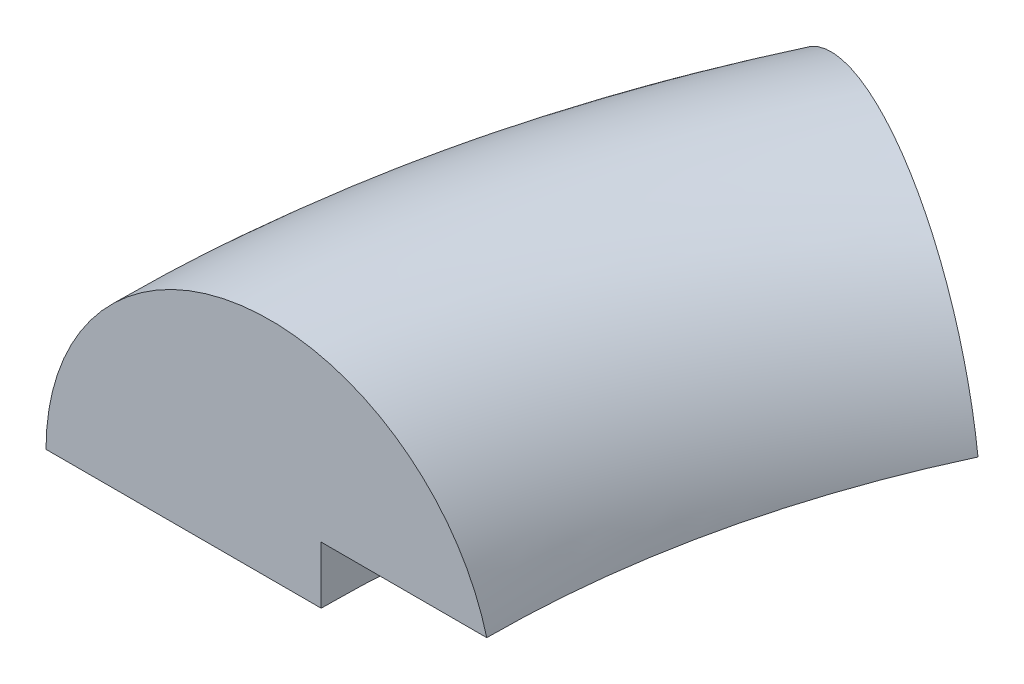
ISO-10303-21;
HEADER;
FILE_DESCRIPTION(('STEP AP214'),'2;1');
FILE_NAME('part.step','',(''),(''),'','','');
FILE_SCHEMA(('AUTOMOTIVE_DESIGN { 1 0 10303 214 1 1 1 1 }'));
ENDSEC;
DATA;
#1=APPLICATION_CONTEXT('core data for automotive mechanical design processes');
#2=APPLICATION_PROTOCOL_DEFINITION('international standard','automotive_design',2000,#1);
#3=PRODUCT_CONTEXT('',#1,'mechanical');
#4=PRODUCT('Part','Part','',(#3));
#5=PRODUCT_RELATED_PRODUCT_CATEGORY('part','',(#4));
#6=PRODUCT_DEFINITION_FORMATION('','',#4);
#7=PRODUCT_DEFINITION_CONTEXT('part definition',#1,'design');
#8=PRODUCT_DEFINITION('design','',#6,#7);
#9=PRODUCT_DEFINITION_SHAPE('','',#8);
#10=(LENGTH_UNIT() NAMED_UNIT(*) SI_UNIT(.MILLI.,.METRE.));
#11=(NAMED_UNIT(*) PLANE_ANGLE_UNIT() SI_UNIT($,.RADIAN.));
#12=(NAMED_UNIT(*) SI_UNIT($,.STERADIAN.) SOLID_ANGLE_UNIT());
#13=UNCERTAINTY_MEASURE_WITH_UNIT(LENGTH_MEASURE(1.E-05),#10,'distance_accuracy_value','');
#14=(GEOMETRIC_REPRESENTATION_CONTEXT(3) GLOBAL_UNCERTAINTY_ASSIGNED_CONTEXT((#13)) GLOBAL_UNIT_ASSIGNED_CONTEXT((#10,
#11,#12)) REPRESENTATION_CONTEXT('',''));
#15=CARTESIAN_POINT('',(0.,0.,0.));
#16=DIRECTION('',(0.,0.,1.));
#17=DIRECTION('',(1.,0.,0.));
#18=AXIS2_PLACEMENT_3D('',#15,#16,#17);
#19=CARTESIAN_POINT('',(0.,0.,0.));
#20=DIRECTION('',(0.,1.,0.));
#21=DIRECTION('',(0.,0.,1.));
#22=AXIS2_PLACEMENT_3D('',#19,#20,#21);
#23=TOROIDAL_SURFACE('',#22,21.2275921635679,4.07240783643207);
#24=CARTESIAN_POINT('',(0.,1.04084600278169,0.));
#25=DIRECTION('',(0.,1.,0.));
#26=DIRECTION('',(0.,0.,1.));
#27=AXIS2_PLACEMENT_3D('',#24,#25,#26);
#28=CIRCLE('',#27,17.2904427906426);
#29=CARTESIAN_POINT('',(-15.670462942471,1.04084600278169,-7.30725687690838));
#30=VERTEX_POINT('',#29);
#31=CARTESIAN_POINT('',(-17.2904427906426,1.04084600278169,0.));
#32=VERTEX_POINT('',#31);
#33=EDGE_CURVE('E11',#30,#32,#28,.T.);
#34=ORIENTED_EDGE('',*,*,#33,.F.);
#35=CARTESIAN_POINT('',(-19.2387320778798,0.,-8.97116810110759));
#36=DIRECTION('',(-0.4226182617407,0.,0.90630778703665));
#37=DIRECTION('',(-0.90630778703665,0.,-0.4226182617407));
#38=AXIS2_PLACEMENT_3D('',#35,#36,#37);
#39=CIRCLE('',#38,4.07240783643207);
#40=CARTESIAN_POINT('',(-22.9295870120272,0.,-10.6922420220397));
#41=VERTEX_POINT('',#40);
#42=EDGE_CURVE('E77',#30,#41,#39,.T.);
#43=ORIENTED_EDGE('',*,*,#42,.T.);
#44=CARTESIAN_POINT('',(0.,0.,0.));
#45=DIRECTION('',(0.,1.,0.));
#46=DIRECTION('',(0.,0.,1.));
#47=AXIS2_PLACEMENT_3D('',#44,#45,#46);
#48=CIRCLE('',#47,25.3);
#49=CARTESIAN_POINT('',(-25.3,0.,0.));
#50=VERTEX_POINT('',#49);
#51=EDGE_CURVE('E72',#41,#50,#48,.T.);
#52=ORIENTED_EDGE('',*,*,#51,.T.);
#53=CARTESIAN_POINT('',(-21.2275921635679,0.,0.));
#54=DIRECTION('',(0.,0.,1.));
#55=DIRECTION('',(-1.,0.,0.));
#56=AXIS2_PLACEMENT_3D('',#53,#54,#55);
#57=CIRCLE('',#56,4.07240783643207);
#58=EDGE_CURVE('E75',#32,#50,#57,.T.);
#59=ORIENTED_EDGE('',*,*,#58,.F.);
#60=EDGE_LOOP('',(#34,#43,#52,#59));
#61=FACE_BOUND('',#60,.T.);
#62=ADVANCED_FACE('F36',(#61),#23,.T.);
#63=CARTESIAN_POINT('',(-18.398048076844,1.04084600278169,-8.57915071333622));
#64=DIRECTION('',(0.,-1.,0.));
#65=DIRECTION('',(0.,0.,-1.));
#66=AXIS2_PLACEMENT_3D('',#63,#64,#65);
#67=PLANE('',#66);
#68=CARTESIAN_POINT('',(0.,1.04084600278169,0.));
#69=DIRECTION('',(0.,1.,0.));
#70=DIRECTION('',(0.,0.,1.));
#71=AXIS2_PLACEMENT_3D('',#68,#69,#70);
#72=CIRCLE('',#71,20.3);
#73=CARTESIAN_POINT('',(-18.398048076844,1.04084600278169,-8.57915071333622));
#74=VERTEX_POINT('',#73);
#75=CARTESIAN_POINT('',(-20.3,1.04084600278169,0.));
#76=VERTEX_POINT('',#75);
#77=EDGE_CURVE('E44',#74,#76,#72,.T.);
#78=ORIENTED_EDGE('',*,*,#77,.F.);
#79=DIRECTION('',(0.906307787036649,0.,0.4226182617407));
#80=VECTOR('',#79,1.);
#81=CARTESIAN_POINT('',(-18.398048076844,1.04084600278169,-8.57915071333622));
#82=LINE('',#81,#80);
#83=EDGE_CURVE('E82',#74,#30,#82,.T.);
#84=ORIENTED_EDGE('',*,*,#83,.T.);
#85=ORIENTED_EDGE('',*,*,#33,.T.);
#86=DIRECTION('',(1.,0.,0.));
#87=VECTOR('',#86,1.);
#88=CARTESIAN_POINT('',(-20.3,1.04084600278169,0.));
#89=LINE('',#88,#87);
#90=EDGE_CURVE('E94',#76,#32,#89,.T.);
#91=ORIENTED_EDGE('',*,*,#90,.F.);
#92=EDGE_LOOP('',(#78,#84,#85,#91));
#93=FACE_BOUND('',#92,.T.);
#94=ADVANCED_FACE('F38',(#93),#67,.T.);
#95=CARTESIAN_POINT('',(0.,5.05895341240825,0.));
#96=DIRECTION('',(0.,1.,0.));
#97=DIRECTION('',(0.,0.,1.));
#98=AXIS2_PLACEMENT_3D('',#95,#96,#97);
#99=CYLINDRICAL_SURFACE('',#98,20.3);
#100=CARTESIAN_POINT('',(0.,0.,0.));
#101=DIRECTION('',(0.,1.,0.));
#102=DIRECTION('',(0.,0.,1.));
#103=AXIS2_PLACEMENT_3D('',#100,#101,#102);
#104=CIRCLE('',#103,20.3);
#105=CARTESIAN_POINT('',(-18.398048076844,0.,-8.57915071333622));
#106=VERTEX_POINT('',#105);
#107=CARTESIAN_POINT('',(-20.3,0.,0.));
#108=VERTEX_POINT('',#107);
#109=EDGE_CURVE('E81',#106,#108,#104,.T.);
#110=ORIENTED_EDGE('',*,*,#109,.F.);
#111=DIRECTION('',(0.,1.,0.));
#112=VECTOR('',#111,1.);
#113=CARTESIAN_POINT('',(-18.398048076844,0.,-8.57915071333622));
#114=LINE('',#113,#112);
#115=EDGE_CURVE('E102',#106,#74,#114,.T.);
#116=ORIENTED_EDGE('',*,*,#115,.T.);
#117=ORIENTED_EDGE('',*,*,#77,.T.);
#118=DIRECTION('',(0.,1.,0.));
#119=VECTOR('',#118,1.);
#120=CARTESIAN_POINT('',(-20.3,0.,0.));
#121=LINE('',#120,#119);
#122=EDGE_CURVE('E90',#108,#76,#121,.T.);
#123=ORIENTED_EDGE('',*,*,#122,.F.);
#124=EDGE_LOOP('',(#110,#116,#117,#123));
#125=FACE_BOUND('',#124,.T.);
#126=ADVANCED_FACE('F106',(#125),#99,.F.);
#127=CARTESIAN_POINT('',(-22.9295870120272,0.,-10.6922420220397));
#128=DIRECTION('',(0.,-1.,0.));
#129=DIRECTION('',(0.,0.,-1.));
#130=AXIS2_PLACEMENT_3D('',#127,#128,#129);
#131=PLANE('',#130);
#132=DIRECTION('',(0.906307787036649,0.,0.4226182617407));
#133=VECTOR('',#132,1.);
#134=CARTESIAN_POINT('',(-22.9295870120272,0.,-10.6922420220397));
#135=LINE('',#134,#133);
#136=EDGE_CURVE('E100',#41,#106,#135,.T.);
#137=ORIENTED_EDGE('',*,*,#136,.T.);
#138=ORIENTED_EDGE('',*,*,#109,.T.);
#139=DIRECTION('',(1.,0.,0.));
#140=VECTOR('',#139,1.);
#141=CARTESIAN_POINT('',(-25.3,0.,0.));
#142=LINE('',#141,#140);
#143=EDGE_CURVE('E85',#50,#108,#142,.T.);
#144=ORIENTED_EDGE('',*,*,#143,.F.);
#145=ORIENTED_EDGE('',*,*,#51,.F.);
#146=EDGE_LOOP('',(#137,#138,#144,#145));
#147=FACE_BOUND('',#146,.T.);
#148=ADVANCED_FACE('F86',(#147),#131,.T.);
#149=CARTESIAN_POINT('',(-19.2387320778798,0.,-8.97116810110759));
#150=DIRECTION('',(0.4226182617407,0.,-0.90630778703665));
#151=DIRECTION('',(-0.90630778703665,0.,-0.4226182617407));
#152=AXIS2_PLACEMENT_3D('',#149,#150,#151);
#153=PLANE('',#152);
#154=ORIENTED_EDGE('',*,*,#42,.F.);
#155=ORIENTED_EDGE('',*,*,#83,.F.);
#156=ORIENTED_EDGE('',*,*,#115,.F.);
#157=ORIENTED_EDGE('',*,*,#136,.F.);
#158=EDGE_LOOP('',(#154,#155,#156,#157));
#159=FACE_BOUND('',#158,.T.);
#160=ADVANCED_FACE('F110',(#159),#153,.T.);
#161=CARTESIAN_POINT('',(-21.2275921635679,0.,0.));
#162=DIRECTION('',(0.,0.,-1.));
#163=DIRECTION('',(-1.,0.,0.));
#164=AXIS2_PLACEMENT_3D('',#161,#162,#163);
#165=PLANE('',#164);
#166=ORIENTED_EDGE('',*,*,#58,.T.);
#167=ORIENTED_EDGE('',*,*,#143,.T.);
#168=ORIENTED_EDGE('',*,*,#122,.T.);
#169=ORIENTED_EDGE('',*,*,#90,.T.);
#170=EDGE_LOOP('',(#166,#167,#168,#169));
#171=FACE_BOUND('',#170,.T.);
#172=ADVANCED_FACE('F93',(#171),#165,.F.);
#173=CLOSED_SHELL('',(#62,#94,#126,#148,#160,#172));
#174=MANIFOLD_SOLID_BREP('B2',#173);
#175=ADVANCED_BREP_SHAPE_REPRESENTATION('',(#18,#174),#14);
#176=SHAPE_DEFINITION_REPRESENTATION(#9,#175);
ENDSEC;
END-ISO-10303-21;
